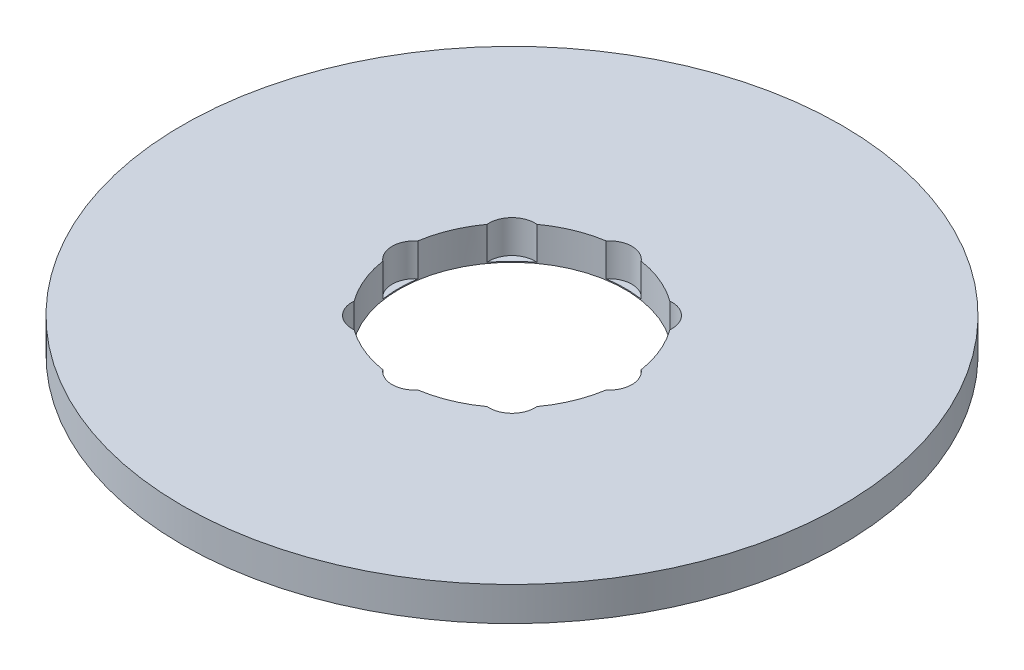
ISO-10303-21;
HEADER;
FILE_DESCRIPTION(('STEP AP214'),'2;1');
FILE_NAME('part.step','',(''),(''),'','','');
FILE_SCHEMA(('AUTOMOTIVE_DESIGN { 1 0 10303 214 1 1 1 1 }'));
ENDSEC;
DATA;
#1=APPLICATION_CONTEXT('core data for automotive mechanical design processes');
#2=APPLICATION_PROTOCOL_DEFINITION('international standard','automotive_design',2000,#1);
#3=PRODUCT_CONTEXT('',#1,'mechanical');
#4=PRODUCT('Part','Part','',(#3));
#5=PRODUCT_RELATED_PRODUCT_CATEGORY('part','',(#4));
#6=PRODUCT_DEFINITION_FORMATION('','',#4);
#7=PRODUCT_DEFINITION_CONTEXT('part definition',#1,'design');
#8=PRODUCT_DEFINITION('design','',#6,#7);
#9=PRODUCT_DEFINITION_SHAPE('','',#8);
#10=(LENGTH_UNIT() NAMED_UNIT(*) SI_UNIT(.MILLI.,.METRE.));
#11=(NAMED_UNIT(*) PLANE_ANGLE_UNIT() SI_UNIT($,.RADIAN.));
#12=(NAMED_UNIT(*) SI_UNIT($,.STERADIAN.) SOLID_ANGLE_UNIT());
#13=UNCERTAINTY_MEASURE_WITH_UNIT(LENGTH_MEASURE(1.E-05),#10,'distance_accuracy_value','');
#14=(GEOMETRIC_REPRESENTATION_CONTEXT(3) GLOBAL_UNCERTAINTY_ASSIGNED_CONTEXT((#13)) GLOBAL_UNIT_ASSIGNED_CONTEXT((#10,
#11,#12)) REPRESENTATION_CONTEXT('',''));
#15=CARTESIAN_POINT('',(0.,0.,0.));
#16=DIRECTION('',(0.,0.,1.));
#17=DIRECTION('',(1.,0.,0.));
#18=AXIS2_PLACEMENT_3D('',#15,#16,#17);
#19=CARTESIAN_POINT('',(0.,9.,0.));
#20=DIRECTION('',(0.,-1.,0.));
#21=DIRECTION('',(0.,0.,-1.));
#22=AXIS2_PLACEMENT_3D('',#19,#20,#21);
#23=CYLINDRICAL_SURFACE('',#22,87.5);
#24=CARTESIAN_POINT('',(0.,9.,0.));
#25=DIRECTION('',(0.,1.,0.));
#26=DIRECTION('',(0.,0.,1.));
#27=AXIS2_PLACEMENT_3D('',#24,#25,#26);
#28=CIRCLE('',#27,87.5);
#29=CARTESIAN_POINT('',(0.,9.,87.5));
#30=VERTEX_POINT('',#29);
#31=EDGE_CURVE('E183',#30,#30,#28,.T.);
#32=ORIENTED_EDGE('',*,*,#31,.F.);
#33=EDGE_LOOP('',(#32));
#34=FACE_BOUND('',#33,.T.);
#35=CARTESIAN_POINT('',(0.,0.,0.));
#36=DIRECTION('',(0.,1.,0.));
#37=DIRECTION('',(0.,0.,1.));
#38=AXIS2_PLACEMENT_3D('',#35,#36,#37);
#39=CIRCLE('',#38,87.5);
#40=CARTESIAN_POINT('',(0.,0.,87.5));
#41=VERTEX_POINT('',#40);
#42=EDGE_CURVE('E182',#41,#41,#39,.T.);
#43=ORIENTED_EDGE('',*,*,#42,.T.);
#44=EDGE_LOOP('',(#43));
#45=FACE_BOUND('',#44,.T.);
#46=ADVANCED_FACE('F39',(#34,#45),#23,.T.);
#47=CARTESIAN_POINT('',(0.,9.,0.));
#48=DIRECTION('',(0.,1.,0.));
#49=DIRECTION('',(0.,0.,1.));
#50=AXIS2_PLACEMENT_3D('',#47,#48,#49);
#51=PLANE('',#50);
#52=CARTESIAN_POINT('',(0.,9.,25.7389934300378));
#53=DIRECTION('',(0.,1.,0.));
#54=DIRECTION('',(1.,0.,0.));
#55=AXIS2_PLACEMENT_3D('',#52,#53,#54);
#56=CIRCLE('',#55,6.08316336212903);
#57=CARTESIAN_POINT('',(-4.67279081784558,9.,29.6338493276297));
#58=VERTEX_POINT('',#57);
#59=CARTESIAN_POINT('',(4.67279081784579,9.,29.6338493276296));
#60=VERTEX_POINT('',#59);
#61=EDGE_CURVE('E256',#58,#60,#56,.T.);
#62=ORIENTED_EDGE('',*,*,#61,.F.);
#63=CARTESIAN_POINT('',(0.,9.,0.));
#64=DIRECTION('',(0.,1.,0.));
#65=DIRECTION('',(0.,0.,1.));
#66=AXIS2_PLACEMENT_3D('',#63,#64,#65);
#67=CIRCLE('',#66,30.);
#68=CARTESIAN_POINT('',(-17.6501337378624,9.,24.2584578865923));
#69=VERTEX_POINT('',#68);
#70=EDGE_CURVE('E175',#69,#58,#67,.T.);
#71=ORIENTED_EDGE('',*,*,#70,.F.);
#72=CARTESIAN_POINT('',(-18.2002167952957,9.,18.2002167952958));
#73=DIRECTION('',(0.,1.,0.));
#74=DIRECTION('',(0.707106781186549,0.,0.707106781186546));
#75=AXIS2_PLACEMENT_3D('',#72,#73,#74);
#76=CIRCLE('',#75,6.08316336212903);
#77=CARTESIAN_POINT('',(-24.2584578865922,9.,17.6501337378625));
#78=VERTEX_POINT('',#77);
#79=EDGE_CURVE('E152',#78,#69,#76,.T.);
#80=ORIENTED_EDGE('',*,*,#79,.F.);
#81=CARTESIAN_POINT('',(-29.6338493276297,9.,4.67279081784568));
#82=VERTEX_POINT('',#81);
#83=EDGE_CURVE('E168',#82,#78,#67,.T.);
#84=ORIENTED_EDGE('',*,*,#83,.F.);
#85=CARTESIAN_POINT('',(-25.7389934300378,9.,0.));
#86=DIRECTION('',(0.,1.,0.));
#87=DIRECTION('',(0.,0.,1.));
#88=AXIS2_PLACEMENT_3D('',#85,#86,#87);
#89=CIRCLE('',#88,6.08316336212903);
#90=CARTESIAN_POINT('',(-29.6338493276297,9.,-4.67279081784568));
#91=VERTEX_POINT('',#90);
#92=EDGE_CURVE('E205',#91,#82,#89,.T.);
#93=ORIENTED_EDGE('',*,*,#92,.F.);
#94=CARTESIAN_POINT('',(-24.2584578865925,9.,-17.6501337378621));
#95=VERTEX_POINT('',#94);
#96=EDGE_CURVE('E181',#95,#91,#67,.T.);
#97=ORIENTED_EDGE('',*,*,#96,.F.);
#98=CARTESIAN_POINT('',(-18.200216795296,9.,-18.2002167952955));
#99=DIRECTION('',(0.,1.,0.));
#100=DIRECTION('',(-0.707106781186539,0.,0.707106781186556));
#101=AXIS2_PLACEMENT_3D('',#98,#99,#100);
#102=CIRCLE('',#101,6.08316336212903);
#103=CARTESIAN_POINT('',(-17.6501337378627,9.,-24.258457886592));
#104=VERTEX_POINT('',#103);
#105=EDGE_CURVE('E453',#104,#95,#102,.T.);
#106=ORIENTED_EDGE('',*,*,#105,.F.);
#107=CARTESIAN_POINT('',(-4.67279081784599,9.,-29.6338493276296));
#108=VERTEX_POINT('',#107);
#109=EDGE_CURVE('E189',#108,#104,#67,.T.);
#110=ORIENTED_EDGE('',*,*,#109,.F.);
#111=CARTESIAN_POINT('',(-2.69601645724749E-13,9.,-25.7389934300378));
#112=DIRECTION('',(0.,1.,0.));
#113=DIRECTION('',(-1.,0.,0.));
#114=AXIS2_PLACEMENT_3D('',#111,#112,#113);
#115=CIRCLE('',#114,6.08316336212903);
#116=CARTESIAN_POINT('',(4.67279081784537,9.,-29.6338493276297));
#117=VERTEX_POINT('',#116);
#118=EDGE_CURVE('E462',#117,#108,#115,.T.);
#119=ORIENTED_EDGE('',*,*,#118,.F.);
#120=CARTESIAN_POINT('',(17.6501337378622,9.,-24.2584578865924));
#121=VERTEX_POINT('',#120);
#122=EDGE_CURVE('E197',#121,#117,#67,.T.);
#123=ORIENTED_EDGE('',*,*,#122,.F.);
#124=CARTESIAN_POINT('',(18.2002167952956,9.,-18.2002167952959));
#125=DIRECTION('',(0.,1.,0.));
#126=DIRECTION('',(-0.707106781186554,0.,-0.707106781186541));
#127=AXIS2_PLACEMENT_3D('',#124,#125,#126);
#128=CIRCLE('',#127,6.08316336212903);
#129=CARTESIAN_POINT('',(24.2584578865921,9.,-17.6501337378626));
#130=VERTEX_POINT('',#129);
#131=EDGE_CURVE('E470',#130,#121,#128,.T.);
#132=ORIENTED_EDGE('',*,*,#131,.F.);
#133=CARTESIAN_POINT('',(29.6338493276297,9.,-4.67279081784568));
#134=VERTEX_POINT('',#133);
#135=EDGE_CURVE('E489',#134,#130,#67,.T.);
#136=ORIENTED_EDGE('',*,*,#135,.F.);
#137=CARTESIAN_POINT('',(25.7389934300378,9.,0.));
#138=DIRECTION('',(0.,1.,0.));
#139=DIRECTION('',(0.,0.,-1.));
#140=AXIS2_PLACEMENT_3D('',#137,#138,#139);
#141=CIRCLE('',#140,6.08316336212903);
#142=CARTESIAN_POINT('',(29.6338493276297,9.,4.67279081784568));
#143=VERTEX_POINT('',#142);
#144=EDGE_CURVE('E476',#143,#134,#141,.T.);
#145=ORIENTED_EDGE('',*,*,#144,.F.);
#146=CARTESIAN_POINT('',(24.2584578865924,9.,17.6501337378623));
#147=VERTEX_POINT('',#146);
#148=EDGE_CURVE('E491',#147,#143,#67,.T.);
#149=ORIENTED_EDGE('',*,*,#148,.F.);
#150=CARTESIAN_POINT('',(18.2002167952958,9.,18.2002167952956));
#151=DIRECTION('',(0.,1.,0.));
#152=DIRECTION('',(0.707106781186544,0.,-0.707106781186551));
#153=AXIS2_PLACEMENT_3D('',#150,#151,#152);
#154=CIRCLE('',#153,6.08316336212903);
#155=CARTESIAN_POINT('',(17.6501337378626,9.,24.2584578865922));
#156=VERTEX_POINT('',#155);
#157=EDGE_CURVE('E475',#156,#147,#154,.T.);
#158=ORIENTED_EDGE('',*,*,#157,.F.);
#159=EDGE_CURVE('E190',#60,#156,#67,.T.);
#160=ORIENTED_EDGE('',*,*,#159,.F.);
#161=EDGE_LOOP('',(#62,#71,#80,#84,#93,#97,#106,#110,#119,#123,#132,#136,#145,#149,#158,#160));
#162=FACE_BOUND('',#161,.T.);
#163=ORIENTED_EDGE('',*,*,#31,.T.);
#164=EDGE_LOOP('',(#163));
#165=FACE_BOUND('',#164,.T.);
#166=ADVANCED_FACE('F170',(#162,#165),#51,.T.);
#167=CARTESIAN_POINT('',(0.,0.,0.));
#168=DIRECTION('',(0.,1.,0.));
#169=DIRECTION('',(0.,0.,1.));
#170=AXIS2_PLACEMENT_3D('',#167,#168,#169);
#171=PLANE('',#170);
#172=CARTESIAN_POINT('',(0.,0.,0.));
#173=DIRECTION('',(0.,1.,0.));
#174=DIRECTION('',(0.,0.,1.));
#175=AXIS2_PLACEMENT_3D('',#172,#173,#174);
#176=CIRCLE('',#175,30.);
#177=CARTESIAN_POINT('',(0.,0.,30.));
#178=VERTEX_POINT('',#177);
#179=EDGE_CURVE('E191',#178,#178,#176,.T.);
#180=ORIENTED_EDGE('',*,*,#179,.T.);
#181=EDGE_LOOP('',(#180));
#182=FACE_BOUND('',#181,.T.);
#183=ORIENTED_EDGE('',*,*,#42,.F.);
#184=EDGE_LOOP('',(#183));
#185=FACE_BOUND('',#184,.T.);
#186=ADVANCED_FACE('F277',(#182,#185),#171,.F.);
#187=CARTESIAN_POINT('',(0.,9.,0.));
#188=DIRECTION('',(0.,-1.,0.));
#189=DIRECTION('',(0.,0.,-1.));
#190=AXIS2_PLACEMENT_3D('',#187,#188,#189);
#191=CYLINDRICAL_SURFACE('',#190,30.);
#192=DIRECTION('',(0.,1.,0.));
#193=VECTOR('',#192,1.);
#194=CARTESIAN_POINT('',(-4.67279081784558,4.63309684656145,29.6338493276297));
#195=LINE('',#194,#193);
#196=CARTESIAN_POINT('',(-4.67279081784558,0.266193693122908,29.6338493276297));
#197=VERTEX_POINT('',#196);
#198=EDGE_CURVE('E11',#197,#58,#195,.T.);
#199=ORIENTED_EDGE('',*,*,#198,.F.);
#200=CARTESIAN_POINT('',(0.,0.266193693122908,0.));
#201=DIRECTION('',(0.,1.,0.));
#202=DIRECTION('',(0.,0.,1.));
#203=AXIS2_PLACEMENT_3D('',#200,#201,#202);
#204=CIRCLE('',#203,30.);
#205=CARTESIAN_POINT('',(4.67279081784579,0.266193693122908,29.6338493276296));
#206=VERTEX_POINT('',#205);
#207=EDGE_CURVE('E251',#197,#206,#204,.T.);
#208=ORIENTED_EDGE('',*,*,#207,.T.);
#209=DIRECTION('',(0.,1.,0.));
#210=VECTOR('',#209,1.);
#211=CARTESIAN_POINT('',(4.67279081784579,4.63309684656145,29.6338493276297));
#212=LINE('',#211,#210);
#213=EDGE_CURVE('E46',#60,#206,#212,.F.);
#214=ORIENTED_EDGE('',*,*,#213,.F.);
#215=ORIENTED_EDGE('',*,*,#159,.T.);
#216=DIRECTION('',(0.,1.,0.));
#217=VECTOR('',#216,1.);
#218=CARTESIAN_POINT('',(17.6501337378625,4.63309684656145,24.2584578865922));
#219=LINE('',#218,#217);
#220=CARTESIAN_POINT('',(17.6501337378626,0.266193693122908,24.2584578865922));
#221=VERTEX_POINT('',#220);
#222=EDGE_CURVE('E253',#221,#156,#219,.T.);
#223=ORIENTED_EDGE('',*,*,#222,.F.);
#224=CARTESIAN_POINT('',(0.,0.266193693122908,0.));
#225=DIRECTION('',(0.,1.,0.));
#226=DIRECTION('',(0.,0.,1.));
#227=AXIS2_PLACEMENT_3D('',#224,#225,#226);
#228=CIRCLE('',#227,30.);
#229=CARTESIAN_POINT('',(24.2584578865924,0.266193693122908,17.6501337378623));
#230=VERTEX_POINT('',#229);
#231=EDGE_CURVE('E246',#221,#230,#228,.T.);
#232=ORIENTED_EDGE('',*,*,#231,.T.);
#233=DIRECTION('',(0.,1.,0.));
#234=VECTOR('',#233,1.);
#235=CARTESIAN_POINT('',(24.2584578865924,4.63309684656145,17.6501337378623));
#236=LINE('',#235,#234);
#237=EDGE_CURVE('E248',#147,#230,#236,.F.);
#238=ORIENTED_EDGE('',*,*,#237,.F.);
#239=ORIENTED_EDGE('',*,*,#148,.T.);
#240=DIRECTION('',(0.,1.,0.));
#241=VECTOR('',#240,1.);
#242=CARTESIAN_POINT('',(29.6338493276297,4.63309684656145,4.67279081784568));
#243=LINE('',#242,#241);
#244=CARTESIAN_POINT('',(29.6338493276297,0.266193693122908,4.67279081784568));
#245=VERTEX_POINT('',#244);
#246=EDGE_CURVE('E243',#245,#143,#243,.T.);
#247=ORIENTED_EDGE('',*,*,#246,.F.);
#248=CARTESIAN_POINT('',(0.,0.266193693122908,0.));
#249=DIRECTION('',(0.,1.,0.));
#250=DIRECTION('',(0.,0.,1.));
#251=AXIS2_PLACEMENT_3D('',#248,#249,#250);
#252=CIRCLE('',#251,30.);
#253=CARTESIAN_POINT('',(29.6338493276297,0.266193693122908,-4.67279081784568));
#254=VERTEX_POINT('',#253);
#255=EDGE_CURVE('E236',#245,#254,#252,.T.);
#256=ORIENTED_EDGE('',*,*,#255,.T.);
#257=DIRECTION('',(0.,1.,0.));
#258=VECTOR('',#257,1.);
#259=CARTESIAN_POINT('',(29.6338493276297,4.63309684656145,-4.67279081784568));
#260=LINE('',#259,#258);
#261=EDGE_CURVE('E241',#134,#254,#260,.F.);
#262=ORIENTED_EDGE('',*,*,#261,.F.);
#263=ORIENTED_EDGE('',*,*,#135,.T.);
#264=DIRECTION('',(0.,1.,0.));
#265=VECTOR('',#264,1.);
#266=CARTESIAN_POINT('',(24.2584578865921,4.63309684656145,-17.6501337378626));
#267=LINE('',#266,#265);
#268=CARTESIAN_POINT('',(24.2584578865921,0.266193693122908,-17.6501337378626));
#269=VERTEX_POINT('',#268);
#270=EDGE_CURVE('E237',#269,#130,#267,.T.);
#271=ORIENTED_EDGE('',*,*,#270,.F.);
#272=CARTESIAN_POINT('',(0.,0.266193693122908,0.));
#273=DIRECTION('',(0.,1.,0.));
#274=DIRECTION('',(0.,0.,1.));
#275=AXIS2_PLACEMENT_3D('',#272,#273,#274);
#276=CIRCLE('',#275,30.);
#277=CARTESIAN_POINT('',(17.6501337378622,0.266193693122908,-24.2584578865924));
#278=VERTEX_POINT('',#277);
#279=EDGE_CURVE('E229',#269,#278,#276,.T.);
#280=ORIENTED_EDGE('',*,*,#279,.T.);
#281=DIRECTION('',(0.,1.,0.));
#282=VECTOR('',#281,1.);
#283=CARTESIAN_POINT('',(17.6501337378622,4.63309684656145,-24.2584578865924));
#284=LINE('',#283,#282);
#285=EDGE_CURVE('E232',#121,#278,#284,.F.);
#286=ORIENTED_EDGE('',*,*,#285,.F.);
#287=ORIENTED_EDGE('',*,*,#122,.T.);
#288=DIRECTION('',(0.,1.,0.));
#289=VECTOR('',#288,1.);
#290=CARTESIAN_POINT('',(4.67279081784537,4.63309684656145,-29.6338493276297));
#291=LINE('',#290,#289);
#292=CARTESIAN_POINT('',(4.67279081784537,0.266193693122908,-29.6338493276297));
#293=VERTEX_POINT('',#292);
#294=EDGE_CURVE('E227',#293,#117,#291,.T.);
#295=ORIENTED_EDGE('',*,*,#294,.F.);
#296=CARTESIAN_POINT('',(0.,0.266193693122908,0.));
#297=DIRECTION('',(0.,1.,0.));
#298=DIRECTION('',(0.,0.,1.));
#299=AXIS2_PLACEMENT_3D('',#296,#297,#298);
#300=CIRCLE('',#299,30.);
#301=CARTESIAN_POINT('',(-4.67279081784599,0.266193693122908,-29.6338493276296));
#302=VERTEX_POINT('',#301);
#303=EDGE_CURVE('E225',#293,#302,#300,.T.);
#304=ORIENTED_EDGE('',*,*,#303,.T.);
#305=DIRECTION('',(0.,1.,0.));
#306=VECTOR('',#305,1.);
#307=CARTESIAN_POINT('',(-4.67279081784599,4.63309684656145,-29.6338493276296));
#308=LINE('',#307,#306);
#309=EDGE_CURVE('E223',#108,#302,#308,.F.);
#310=ORIENTED_EDGE('',*,*,#309,.F.);
#311=ORIENTED_EDGE('',*,*,#109,.T.);
#312=DIRECTION('',(0.,1.,0.));
#313=VECTOR('',#312,1.);
#314=CARTESIAN_POINT('',(-17.6501337378627,4.63309684656145,-24.258457886592));
#315=LINE('',#314,#313);
#316=CARTESIAN_POINT('',(-17.6501337378627,0.266193693122908,-24.258457886592));
#317=VERTEX_POINT('',#316);
#318=EDGE_CURVE('E219',#317,#104,#315,.T.);
#319=ORIENTED_EDGE('',*,*,#318,.F.);
#320=CARTESIAN_POINT('',(0.,0.266193693122908,0.));
#321=DIRECTION('',(0.,1.,0.));
#322=DIRECTION('',(0.,0.,1.));
#323=AXIS2_PLACEMENT_3D('',#320,#321,#322);
#324=CIRCLE('',#323,30.);
#325=CARTESIAN_POINT('',(-24.2584578865925,0.266193693122908,-17.6501337378621));
#326=VERTEX_POINT('',#325);
#327=EDGE_CURVE('E159',#317,#326,#324,.T.);
#328=ORIENTED_EDGE('',*,*,#327,.T.);
#329=DIRECTION('',(0.,1.,0.));
#330=VECTOR('',#329,1.);
#331=CARTESIAN_POINT('',(-24.2584578865925,4.63309684656145,-17.6501337378621));
#332=LINE('',#331,#330);
#333=EDGE_CURVE('E220',#95,#326,#332,.F.);
#334=ORIENTED_EDGE('',*,*,#333,.F.);
#335=ORIENTED_EDGE('',*,*,#96,.T.);
#336=DIRECTION('',(0.,1.,0.));
#337=VECTOR('',#336,1.);
#338=CARTESIAN_POINT('',(-29.6338493276297,4.63309684656145,-4.67279081784568));
#339=LINE('',#338,#337);
#340=CARTESIAN_POINT('',(-29.6338493276297,0.266193693122908,-4.67279081784568));
#341=VERTEX_POINT('',#340);
#342=EDGE_CURVE('E209',#341,#91,#339,.T.);
#343=ORIENTED_EDGE('',*,*,#342,.F.);
#344=CARTESIAN_POINT('',(0.,0.266193693122908,0.));
#345=DIRECTION('',(0.,1.,0.));
#346=DIRECTION('',(0.,0.,1.));
#347=AXIS2_PLACEMENT_3D('',#344,#345,#346);
#348=CIRCLE('',#347,30.);
#349=CARTESIAN_POINT('',(-29.6338493276297,0.266193693122908,4.67279081784568));
#350=VERTEX_POINT('',#349);
#351=EDGE_CURVE('E206',#341,#350,#348,.T.);
#352=ORIENTED_EDGE('',*,*,#351,.T.);
#353=DIRECTION('',(0.,1.,0.));
#354=VECTOR('',#353,1.);
#355=CARTESIAN_POINT('',(-29.6338493276297,4.63309684656145,4.67279081784568));
#356=LINE('',#355,#354);
#357=EDGE_CURVE('E179',#82,#350,#356,.F.);
#358=ORIENTED_EDGE('',*,*,#357,.F.);
#359=ORIENTED_EDGE('',*,*,#83,.T.);
#360=DIRECTION('',(0.,1.,0.));
#361=VECTOR('',#360,1.);
#362=CARTESIAN_POINT('',(-24.2584578865922,4.63309684656145,17.6501337378625));
#363=LINE('',#362,#361);
#364=CARTESIAN_POINT('',(-24.2584578865922,0.266193693122908,17.6501337378625));
#365=VERTEX_POINT('',#364);
#366=EDGE_CURVE('E147',#365,#78,#363,.T.);
#367=ORIENTED_EDGE('',*,*,#366,.F.);
#368=CARTESIAN_POINT('',(0.,0.266193693122908,0.));
#369=DIRECTION('',(0.,1.,0.));
#370=DIRECTION('',(0.,0.,1.));
#371=AXIS2_PLACEMENT_3D('',#368,#369,#370);
#372=CIRCLE('',#371,30.);
#373=CARTESIAN_POINT('',(-17.6501337378624,0.266193693122908,24.2584578865923));
#374=VERTEX_POINT('',#373);
#375=EDGE_CURVE('E215',#365,#374,#372,.T.);
#376=ORIENTED_EDGE('',*,*,#375,.T.);
#377=DIRECTION('',(0.,1.,0.));
#378=VECTOR('',#377,1.);
#379=CARTESIAN_POINT('',(-17.6501337378624,4.63309684656145,24.2584578865923));
#380=LINE('',#379,#378);
#381=EDGE_CURVE('E161',#69,#374,#380,.F.);
#382=ORIENTED_EDGE('',*,*,#381,.F.);
#383=ORIENTED_EDGE('',*,*,#70,.T.);
#384=EDGE_LOOP('',(#199,#208,#214,#215,#223,#232,#238,#239,#247,#256,#262,#263,#271,#280,#286,
#287,#295,#304,#310,#311,#319,#328,#334,#335,#343,#352,#358,#359,#367,#376,#382,#383));
#385=FACE_BOUND('',#384,.T.);
#386=ORIENTED_EDGE('',*,*,#179,.F.);
#387=EDGE_LOOP('',(#386));
#388=FACE_BOUND('',#387,.T.);
#389=ADVANCED_FACE('F176',(#385,#388),#191,.F.);
#390=CARTESIAN_POINT('',(-25.7389934300378,0.266193693122908,0.));
#391=DIRECTION('',(0.,1.,0.));
#392=DIRECTION('',(0.,0.,1.));
#393=AXIS2_PLACEMENT_3D('',#390,#391,#392);
#394=CYLINDRICAL_SURFACE('',#393,6.08316336212903);
#395=ORIENTED_EDGE('',*,*,#342,.T.);
#396=ORIENTED_EDGE('',*,*,#92,.T.);
#397=ORIENTED_EDGE('',*,*,#357,.T.);
#398=CARTESIAN_POINT('',(-25.7389934300378,0.266193693122908,0.));
#399=DIRECTION('',(0.,1.,0.));
#400=DIRECTION('',(0.,0.,1.));
#401=AXIS2_PLACEMENT_3D('',#398,#399,#400);
#402=CIRCLE('',#401,6.08316336212903);
#403=EDGE_CURVE('E200',#341,#350,#402,.T.);
#404=ORIENTED_EDGE('',*,*,#403,.F.);
#405=EDGE_LOOP('',(#395,#396,#397,#404));
#406=FACE_BOUND('',#405,.T.);
#407=ADVANCED_FACE('F286',(#406),#394,.F.);
#408=CARTESIAN_POINT('',(-25.7389934300378,0.266193693122908,0.));
#409=DIRECTION('',(0.,1.,0.));
#410=DIRECTION('',(0.,0.,1.));
#411=AXIS2_PLACEMENT_3D('',#408,#409,#410);
#412=PLANE('',#411);
#413=ORIENTED_EDGE('',*,*,#403,.T.);
#414=ORIENTED_EDGE('',*,*,#351,.F.);
#415=EDGE_LOOP('',(#413,#414));
#416=FACE_BOUND('',#415,.T.);
#417=ADVANCED_FACE('F289',(#416),#412,.T.);
#418=CARTESIAN_POINT('',(-18.2002167952957,0.266193693122908,18.2002167952958));
#419=DIRECTION('',(0.,1.,0.));
#420=DIRECTION('',(0.,0.,1.));
#421=AXIS2_PLACEMENT_3D('',#418,#419,#420);
#422=CYLINDRICAL_SURFACE('',#421,6.08316336212903);
#423=ORIENTED_EDGE('',*,*,#366,.T.);
#424=ORIENTED_EDGE('',*,*,#79,.T.);
#425=ORIENTED_EDGE('',*,*,#381,.T.);
#426=CARTESIAN_POINT('',(-18.2002167952957,0.266193693122908,18.2002167952958));
#427=DIRECTION('',(0.,1.,0.));
#428=DIRECTION('',(0.707106781186549,0.,0.707106781186546));
#429=AXIS2_PLACEMENT_3D('',#426,#427,#428);
#430=CIRCLE('',#429,6.08316336212903);
#431=EDGE_CURVE('E156',#365,#374,#430,.T.);
#432=ORIENTED_EDGE('',*,*,#431,.F.);
#433=EDGE_LOOP('',(#423,#424,#425,#432));
#434=FACE_BOUND('',#433,.T.);
#435=ADVANCED_FACE('F155',(#434),#422,.F.);
#436=CARTESIAN_POINT('',(-18.2002167952957,0.266193693122908,18.2002167952958));
#437=DIRECTION('',(0.,1.,0.));
#438=DIRECTION('',(0.707106781186549,0.,0.707106781186546));
#439=AXIS2_PLACEMENT_3D('',#436,#437,#438);
#440=PLANE('',#439);
#441=ORIENTED_EDGE('',*,*,#431,.T.);
#442=ORIENTED_EDGE('',*,*,#375,.F.);
#443=EDGE_LOOP('',(#441,#442));
#444=FACE_BOUND('',#443,.T.);
#445=ADVANCED_FACE('F300',(#444),#440,.T.);
#446=CARTESIAN_POINT('',(-18.200216795296,0.266193693122908,-18.2002167952955));
#447=DIRECTION('',(0.,1.,0.));
#448=DIRECTION('',(0.,0.,1.));
#449=AXIS2_PLACEMENT_3D('',#446,#447,#448);
#450=CYLINDRICAL_SURFACE('',#449,6.08316336212903);
#451=ORIENTED_EDGE('',*,*,#318,.T.);
#452=ORIENTED_EDGE('',*,*,#105,.T.);
#453=ORIENTED_EDGE('',*,*,#333,.T.);
#454=CARTESIAN_POINT('',(-18.200216795296,0.266193693122908,-18.2002167952955));
#455=DIRECTION('',(0.,1.,0.));
#456=DIRECTION('',(-0.707106781186539,0.,0.707106781186556));
#457=AXIS2_PLACEMENT_3D('',#454,#455,#456);
#458=CIRCLE('',#457,6.08316336212903);
#459=EDGE_CURVE('E454',#317,#326,#458,.T.);
#460=ORIENTED_EDGE('',*,*,#459,.F.);
#461=EDGE_LOOP('',(#451,#452,#453,#460));
#462=FACE_BOUND('',#461,.T.);
#463=ADVANCED_FACE('F299',(#462),#450,.F.);
#464=CARTESIAN_POINT('',(-18.200216795296,0.266193693122908,-18.2002167952955));
#465=DIRECTION('',(0.,1.,0.));
#466=DIRECTION('',(-0.707106781186539,0.,0.707106781186556));
#467=AXIS2_PLACEMENT_3D('',#464,#465,#466);
#468=PLANE('',#467);
#469=ORIENTED_EDGE('',*,*,#459,.T.);
#470=ORIENTED_EDGE('',*,*,#327,.F.);
#471=EDGE_LOOP('',(#469,#470));
#472=FACE_BOUND('',#471,.T.);
#473=ADVANCED_FACE('F379',(#472),#468,.T.);
#474=CARTESIAN_POINT('',(-2.69601645724749E-13,0.266193693122908,-25.7389934300378));
#475=DIRECTION('',(0.,1.,0.));
#476=DIRECTION('',(0.,0.,1.));
#477=AXIS2_PLACEMENT_3D('',#474,#475,#476);
#478=CYLINDRICAL_SURFACE('',#477,6.08316336212903);
#479=ORIENTED_EDGE('',*,*,#294,.T.);
#480=ORIENTED_EDGE('',*,*,#118,.T.);
#481=ORIENTED_EDGE('',*,*,#309,.T.);
#482=CARTESIAN_POINT('',(-2.69601645724749E-13,0.266193693122908,-25.7389934300378));
#483=DIRECTION('',(0.,1.,0.));
#484=DIRECTION('',(-1.,0.,0.));
#485=AXIS2_PLACEMENT_3D('',#482,#483,#484);
#486=CIRCLE('',#485,6.08316336212903);
#487=EDGE_CURVE('E465',#293,#302,#486,.T.);
#488=ORIENTED_EDGE('',*,*,#487,.F.);
#489=EDGE_LOOP('',(#479,#480,#481,#488));
#490=FACE_BOUND('',#489,.T.);
#491=ADVANCED_FACE('F371',(#490),#478,.F.);
#492=CARTESIAN_POINT('',(-2.69601645724749E-13,0.266193693122908,-25.7389934300378));
#493=DIRECTION('',(0.,1.,0.));
#494=DIRECTION('',(-1.,0.,0.));
#495=AXIS2_PLACEMENT_3D('',#492,#493,#494);
#496=PLANE('',#495);
#497=ORIENTED_EDGE('',*,*,#487,.T.);
#498=ORIENTED_EDGE('',*,*,#303,.F.);
#499=EDGE_LOOP('',(#497,#498));
#500=FACE_BOUND('',#499,.T.);
#501=ADVANCED_FACE('F308',(#500),#496,.T.);
#502=CARTESIAN_POINT('',(18.2002167952956,0.266193693122908,-18.2002167952959));
#503=DIRECTION('',(0.,1.,0.));
#504=DIRECTION('',(0.,0.,1.));
#505=AXIS2_PLACEMENT_3D('',#502,#503,#504);
#506=CYLINDRICAL_SURFACE('',#505,6.08316336212903);
#507=ORIENTED_EDGE('',*,*,#270,.T.);
#508=ORIENTED_EDGE('',*,*,#131,.T.);
#509=ORIENTED_EDGE('',*,*,#285,.T.);
#510=CARTESIAN_POINT('',(18.2002167952956,0.266193693122908,-18.2002167952959));
#511=DIRECTION('',(0.,1.,0.));
#512=DIRECTION('',(-0.707106781186554,0.,-0.707106781186541));
#513=AXIS2_PLACEMENT_3D('',#510,#511,#512);
#514=CIRCLE('',#513,6.08316336212903);
#515=EDGE_CURVE('E477',#269,#278,#514,.T.);
#516=ORIENTED_EDGE('',*,*,#515,.F.);
#517=EDGE_LOOP('',(#507,#508,#509,#516));
#518=FACE_BOUND('',#517,.T.);
#519=ADVANCED_FACE('F305',(#518),#506,.F.);
#520=CARTESIAN_POINT('',(18.2002167952956,0.266193693122908,-18.2002167952959));
#521=DIRECTION('',(0.,1.,0.));
#522=DIRECTION('',(-0.707106781186554,0.,-0.707106781186541));
#523=AXIS2_PLACEMENT_3D('',#520,#521,#522);
#524=PLANE('',#523);
#525=ORIENTED_EDGE('',*,*,#515,.T.);
#526=ORIENTED_EDGE('',*,*,#279,.F.);
#527=EDGE_LOOP('',(#525,#526));
#528=FACE_BOUND('',#527,.T.);
#529=ADVANCED_FACE('F304',(#528),#524,.T.);
#530=CARTESIAN_POINT('',(25.7389934300378,0.266193693122908,0.));
#531=DIRECTION('',(0.,1.,0.));
#532=DIRECTION('',(0.,0.,1.));
#533=AXIS2_PLACEMENT_3D('',#530,#531,#532);
#534=CYLINDRICAL_SURFACE('',#533,6.08316336212903);
#535=ORIENTED_EDGE('',*,*,#246,.T.);
#536=ORIENTED_EDGE('',*,*,#144,.T.);
#537=ORIENTED_EDGE('',*,*,#261,.T.);
#538=CARTESIAN_POINT('',(25.7389934300378,0.266193693122908,0.));
#539=DIRECTION('',(0.,1.,0.));
#540=DIRECTION('',(0.,0.,-1.));
#541=AXIS2_PLACEMENT_3D('',#538,#539,#540);
#542=CIRCLE('',#541,6.08316336212903);
#543=EDGE_CURVE('E478',#245,#254,#542,.T.);
#544=ORIENTED_EDGE('',*,*,#543,.F.);
#545=EDGE_LOOP('',(#535,#536,#537,#544));
#546=FACE_BOUND('',#545,.T.);
#547=ADVANCED_FACE('F309',(#546),#534,.F.);
#548=CARTESIAN_POINT('',(25.7389934300378,0.266193693122908,0.));
#549=DIRECTION('',(0.,1.,0.));
#550=DIRECTION('',(0.,0.,-1.));
#551=AXIS2_PLACEMENT_3D('',#548,#549,#550);
#552=PLANE('',#551);
#553=ORIENTED_EDGE('',*,*,#543,.T.);
#554=ORIENTED_EDGE('',*,*,#255,.F.);
#555=EDGE_LOOP('',(#553,#554));
#556=FACE_BOUND('',#555,.T.);
#557=ADVANCED_FACE('F314',(#556),#552,.T.);
#558=CARTESIAN_POINT('',(18.2002167952958,0.266193693122908,18.2002167952956));
#559=DIRECTION('',(0.,1.,0.));
#560=DIRECTION('',(0.,0.,1.));
#561=AXIS2_PLACEMENT_3D('',#558,#559,#560);
#562=CYLINDRICAL_SURFACE('',#561,6.08316336212903);
#563=ORIENTED_EDGE('',*,*,#222,.T.);
#564=ORIENTED_EDGE('',*,*,#157,.T.);
#565=ORIENTED_EDGE('',*,*,#237,.T.);
#566=CARTESIAN_POINT('',(18.2002167952958,0.266193693122908,18.2002167952956));
#567=DIRECTION('',(0.,1.,0.));
#568=DIRECTION('',(0.707106781186544,0.,-0.707106781186551));
#569=AXIS2_PLACEMENT_3D('',#566,#567,#568);
#570=CIRCLE('',#569,6.08316336212903);
#571=EDGE_CURVE('E56',#221,#230,#570,.T.);
#572=ORIENTED_EDGE('',*,*,#571,.F.);
#573=EDGE_LOOP('',(#563,#564,#565,#572));
#574=FACE_BOUND('',#573,.T.);
#575=ADVANCED_FACE('F318',(#574),#562,.F.);
#576=CARTESIAN_POINT('',(18.2002167952958,0.266193693122908,18.2002167952956));
#577=DIRECTION('',(0.,1.,0.));
#578=DIRECTION('',(0.707106781186544,0.,-0.707106781186551));
#579=AXIS2_PLACEMENT_3D('',#576,#577,#578);
#580=PLANE('',#579);
#581=ORIENTED_EDGE('',*,*,#571,.T.);
#582=ORIENTED_EDGE('',*,*,#231,.F.);
#583=EDGE_LOOP('',(#581,#582));
#584=FACE_BOUND('',#583,.T.);
#585=ADVANCED_FACE('F270',(#584),#580,.T.);
#586=CARTESIAN_POINT('',(0.,0.266193693122908,25.7389934300378));
#587=DIRECTION('',(0.,1.,0.));
#588=DIRECTION('',(0.,0.,1.));
#589=AXIS2_PLACEMENT_3D('',#586,#587,#588);
#590=CYLINDRICAL_SURFACE('',#589,6.08316336212903);
#591=ORIENTED_EDGE('',*,*,#198,.T.);
#592=ORIENTED_EDGE('',*,*,#61,.T.);
#593=ORIENTED_EDGE('',*,*,#213,.T.);
#594=CARTESIAN_POINT('',(0.,0.266193693122908,25.7389934300378));
#595=DIRECTION('',(0.,1.,0.));
#596=DIRECTION('',(1.,0.,0.));
#597=AXIS2_PLACEMENT_3D('',#594,#595,#596);
#598=CIRCLE('',#597,6.08316336212903);
#599=EDGE_CURVE('E55',#197,#206,#598,.T.);
#600=ORIENTED_EDGE('',*,*,#599,.F.);
#601=EDGE_LOOP('',(#591,#592,#593,#600));
#602=FACE_BOUND('',#601,.T.);
#603=ADVANCED_FACE('F260',(#602),#590,.F.);
#604=CARTESIAN_POINT('',(0.,0.266193693122908,25.7389934300378));
#605=DIRECTION('',(0.,1.,0.));
#606=DIRECTION('',(1.,0.,0.));
#607=AXIS2_PLACEMENT_3D('',#604,#605,#606);
#608=PLANE('',#607);
#609=ORIENTED_EDGE('',*,*,#599,.T.);
#610=ORIENTED_EDGE('',*,*,#207,.F.);
#611=EDGE_LOOP('',(#609,#610));
#612=FACE_BOUND('',#611,.T.);
#613=ADVANCED_FACE('F261',(#612),#608,.T.);
#614=CLOSED_SHELL('',(#46,#166,#186,#389,#407,#417,#435,#445,#463,#473,#491,#501,#519,#529,#547,
#557,#575,#585,#603,#613));
#615=MANIFOLD_SOLID_BREP('B2',#614);
#616=ADVANCED_BREP_SHAPE_REPRESENTATION('',(#18,#615),#14);
#617=SHAPE_DEFINITION_REPRESENTATION(#9,#616);
ENDSEC;
END-ISO-10303-21;
